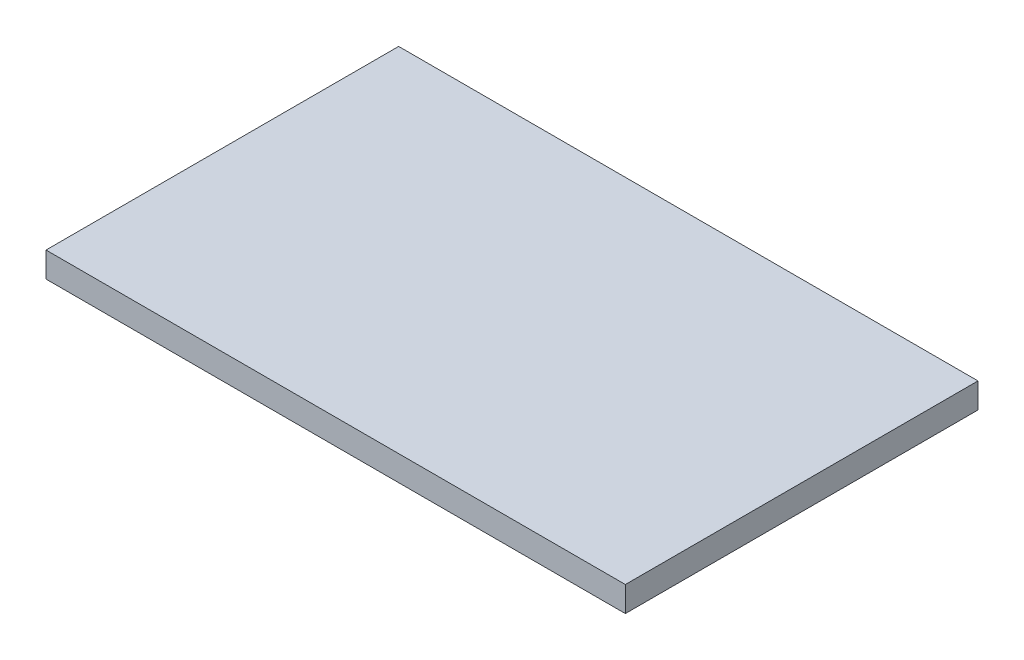
ISO-10303-21;
HEADER;
FILE_DESCRIPTION(('STEP AP214'),'2;1');
FILE_NAME('part.step','',(''),(''),'','','');
FILE_SCHEMA(('AUTOMOTIVE_DESIGN { 1 0 10303 214 1 1 1 1 }'));
ENDSEC;
DATA;
#1=APPLICATION_CONTEXT('core data for automotive mechanical design processes');
#2=APPLICATION_PROTOCOL_DEFINITION('international standard','automotive_design',2000,#1);
#3=PRODUCT_CONTEXT('',#1,'mechanical');
#4=PRODUCT('Part','Part','',(#3));
#5=PRODUCT_RELATED_PRODUCT_CATEGORY('part','',(#4));
#6=PRODUCT_DEFINITION_FORMATION('','',#4);
#7=PRODUCT_DEFINITION_CONTEXT('part definition',#1,'design');
#8=PRODUCT_DEFINITION('design','',#6,#7);
#9=PRODUCT_DEFINITION_SHAPE('','',#8);
#10=(LENGTH_UNIT() NAMED_UNIT(*) SI_UNIT(.MILLI.,.METRE.));
#11=(NAMED_UNIT(*) PLANE_ANGLE_UNIT() SI_UNIT($,.RADIAN.));
#12=(NAMED_UNIT(*) SI_UNIT($,.STERADIAN.) SOLID_ANGLE_UNIT());
#13=UNCERTAINTY_MEASURE_WITH_UNIT(LENGTH_MEASURE(1.E-05),#10,'distance_accuracy_value','');
#14=(GEOMETRIC_REPRESENTATION_CONTEXT(3) GLOBAL_UNCERTAINTY_ASSIGNED_CONTEXT((#13)) GLOBAL_UNIT_ASSIGNED_CONTEXT((#10,
#11,#12)) REPRESENTATION_CONTEXT('',''));
#15=CARTESIAN_POINT('',(0.,0.,0.));
#16=DIRECTION('',(0.,0.,1.));
#17=DIRECTION('',(1.,0.,0.));
#18=AXIS2_PLACEMENT_3D('',#15,#16,#17);
#19=CARTESIAN_POINT('',(584.2,50.8,355.6));
#20=DIRECTION('',(-1.,0.,0.));
#21=DIRECTION('',(0.,0.,1.));
#22=AXIS2_PLACEMENT_3D('',#19,#20,#21);
#23=PLANE('',#22);
#24=DIRECTION('',(0.,0.,-1.));
#25=VECTOR('',#24,1.);
#26=CARTESIAN_POINT('',(584.2,0.,355.6));
#27=LINE('',#26,#25);
#28=CARTESIAN_POINT('',(584.2,0.,355.6));
#29=VERTEX_POINT('',#28);
#30=CARTESIAN_POINT('',(584.2,0.,-355.6));
#31=VERTEX_POINT('',#30);
#32=EDGE_CURVE('E96',#29,#31,#27,.T.);
#33=ORIENTED_EDGE('',*,*,#32,.T.);
#34=DIRECTION('',(0.,-1.,0.));
#35=VECTOR('',#34,1.);
#36=CARTESIAN_POINT('',(584.2,50.8,-355.6));
#37=LINE('',#36,#35);
#38=CARTESIAN_POINT('',(584.2,50.8,-355.6));
#39=VERTEX_POINT('',#38);
#40=EDGE_CURVE('E11',#39,#31,#37,.T.);
#41=ORIENTED_EDGE('',*,*,#40,.F.);
#42=DIRECTION('',(0.,0.,-1.));
#43=VECTOR('',#42,1.);
#44=CARTESIAN_POINT('',(584.2,50.8,355.6));
#45=LINE('',#44,#43);
#46=CARTESIAN_POINT('',(584.2,50.8,355.6));
#47=VERTEX_POINT('',#46);
#48=EDGE_CURVE('E84',#47,#39,#45,.T.);
#49=ORIENTED_EDGE('',*,*,#48,.F.);
#50=DIRECTION('',(0.,-1.,0.));
#51=VECTOR('',#50,1.);
#52=CARTESIAN_POINT('',(584.2,50.8,355.6));
#53=LINE('',#52,#51);
#54=EDGE_CURVE('E92',#47,#29,#53,.T.);
#55=ORIENTED_EDGE('',*,*,#54,.T.);
#56=EDGE_LOOP('',(#33,#41,#49,#55));
#57=FACE_BOUND('',#56,.T.);
#58=ADVANCED_FACE('F33',(#57),#23,.F.);
#59=CARTESIAN_POINT('',(-584.2,50.8,-355.6));
#60=DIRECTION('',(0.,0.,1.));
#61=DIRECTION('',(1.,0.,0.));
#62=AXIS2_PLACEMENT_3D('',#59,#60,#61);
#63=PLANE('',#62);
#64=DIRECTION('',(-1.,0.,0.));
#65=VECTOR('',#64,1.);
#66=CARTESIAN_POINT('',(-584.2,0.,-355.6));
#67=LINE('',#66,#65);
#68=CARTESIAN_POINT('',(-584.2,0.,-355.6));
#69=VERTEX_POINT('',#68);
#70=EDGE_CURVE('E88',#31,#69,#67,.T.);
#71=ORIENTED_EDGE('',*,*,#70,.T.);
#72=DIRECTION('',(0.,-1.,0.));
#73=VECTOR('',#72,1.);
#74=CARTESIAN_POINT('',(-584.2,50.8,-355.6));
#75=LINE('',#74,#73);
#76=CARTESIAN_POINT('',(-584.2,50.8,-355.6));
#77=VERTEX_POINT('',#76);
#78=EDGE_CURVE('E41',#77,#69,#75,.T.);
#79=ORIENTED_EDGE('',*,*,#78,.F.);
#80=DIRECTION('',(-1.,0.,0.));
#81=VECTOR('',#80,1.);
#82=CARTESIAN_POINT('',(-584.2,50.8,-355.6));
#83=LINE('',#82,#81);
#84=EDGE_CURVE('E79',#39,#77,#83,.T.);
#85=ORIENTED_EDGE('',*,*,#84,.F.);
#86=ORIENTED_EDGE('',*,*,#40,.T.);
#87=EDGE_LOOP('',(#71,#79,#85,#86));
#88=FACE_BOUND('',#87,.T.);
#89=ADVANCED_FACE('F87',(#88),#63,.F.);
#90=CARTESIAN_POINT('',(-584.2,50.8,355.6));
#91=DIRECTION('',(1.,0.,0.));
#92=DIRECTION('',(0.,0.,-1.));
#93=AXIS2_PLACEMENT_3D('',#90,#91,#92);
#94=PLANE('',#93);
#95=DIRECTION('',(0.,0.,1.));
#96=VECTOR('',#95,1.);
#97=CARTESIAN_POINT('',(-584.2,0.,355.6));
#98=LINE('',#97,#96);
#99=CARTESIAN_POINT('',(-584.2,0.,355.6));
#100=VERTEX_POINT('',#99);
#101=EDGE_CURVE('E66',#69,#100,#98,.T.);
#102=ORIENTED_EDGE('',*,*,#101,.T.);
#103=DIRECTION('',(0.,-1.,0.));
#104=VECTOR('',#103,1.);
#105=CARTESIAN_POINT('',(-584.2,50.8,355.6));
#106=LINE('',#105,#104);
#107=CARTESIAN_POINT('',(-584.2,50.8,355.6));
#108=VERTEX_POINT('',#107);
#109=EDGE_CURVE('E89',#108,#100,#106,.T.);
#110=ORIENTED_EDGE('',*,*,#109,.F.);
#111=DIRECTION('',(0.,0.,1.));
#112=VECTOR('',#111,1.);
#113=CARTESIAN_POINT('',(-584.2,50.8,355.6));
#114=LINE('',#113,#112);
#115=EDGE_CURVE('E82',#77,#108,#114,.T.);
#116=ORIENTED_EDGE('',*,*,#115,.F.);
#117=ORIENTED_EDGE('',*,*,#78,.T.);
#118=EDGE_LOOP('',(#102,#110,#116,#117));
#119=FACE_BOUND('',#118,.T.);
#120=ADVANCED_FACE('F90',(#119),#94,.F.);
#121=CARTESIAN_POINT('',(-584.2,50.8,355.6));
#122=DIRECTION('',(0.,0.,-1.));
#123=DIRECTION('',(-1.,0.,0.));
#124=AXIS2_PLACEMENT_3D('',#121,#122,#123);
#125=PLANE('',#124);
#126=DIRECTION('',(1.,0.,0.));
#127=VECTOR('',#126,1.);
#128=CARTESIAN_POINT('',(-584.2,0.,355.6));
#129=LINE('',#128,#127);
#130=EDGE_CURVE('E72',#100,#29,#129,.T.);
#131=ORIENTED_EDGE('',*,*,#130,.T.);
#132=ORIENTED_EDGE('',*,*,#54,.F.);
#133=DIRECTION('',(1.,0.,0.));
#134=VECTOR('',#133,1.);
#135=CARTESIAN_POINT('',(-584.2,50.8,355.6));
#136=LINE('',#135,#134);
#137=EDGE_CURVE('E49',#108,#47,#136,.T.);
#138=ORIENTED_EDGE('',*,*,#137,.F.);
#139=ORIENTED_EDGE('',*,*,#109,.T.);
#140=EDGE_LOOP('',(#131,#132,#138,#139));
#141=FACE_BOUND('',#140,.T.);
#142=ADVANCED_FACE('F103',(#141),#125,.F.);
#143=CARTESIAN_POINT('',(0.,50.8,0.));
#144=DIRECTION('',(0.,-1.,0.));
#145=DIRECTION('',(0.,0.,-1.));
#146=AXIS2_PLACEMENT_3D('',#143,#144,#145);
#147=PLANE('',#146);
#148=ORIENTED_EDGE('',*,*,#48,.T.);
#149=ORIENTED_EDGE('',*,*,#84,.T.);
#150=ORIENTED_EDGE('',*,*,#115,.T.);
#151=ORIENTED_EDGE('',*,*,#137,.T.);
#152=EDGE_LOOP('',(#148,#149,#150,#151));
#153=FACE_BOUND('',#152,.T.);
#154=ADVANCED_FACE('F80',(#153),#147,.F.);
#155=CARTESIAN_POINT('',(0.,0.,0.));
#156=DIRECTION('',(0.,-1.,0.));
#157=DIRECTION('',(0.,0.,-1.));
#158=AXIS2_PLACEMENT_3D('',#155,#156,#157);
#159=PLANE('',#158);
#160=ORIENTED_EDGE('',*,*,#32,.F.);
#161=ORIENTED_EDGE('',*,*,#130,.F.);
#162=ORIENTED_EDGE('',*,*,#101,.F.);
#163=ORIENTED_EDGE('',*,*,#70,.F.);
#164=EDGE_LOOP('',(#160,#161,#162,#163));
#165=FACE_BOUND('',#164,.T.);
#166=ADVANCED_FACE('F106',(#165),#159,.T.);
#167=CLOSED_SHELL('',(#58,#89,#120,#142,#154,#166));
#168=MANIFOLD_SOLID_BREP('B2',#167);
#169=ADVANCED_BREP_SHAPE_REPRESENTATION('',(#18,#168),#14);
#170=SHAPE_DEFINITION_REPRESENTATION(#9,#169);
ENDSEC;
END-ISO-10303-21;
